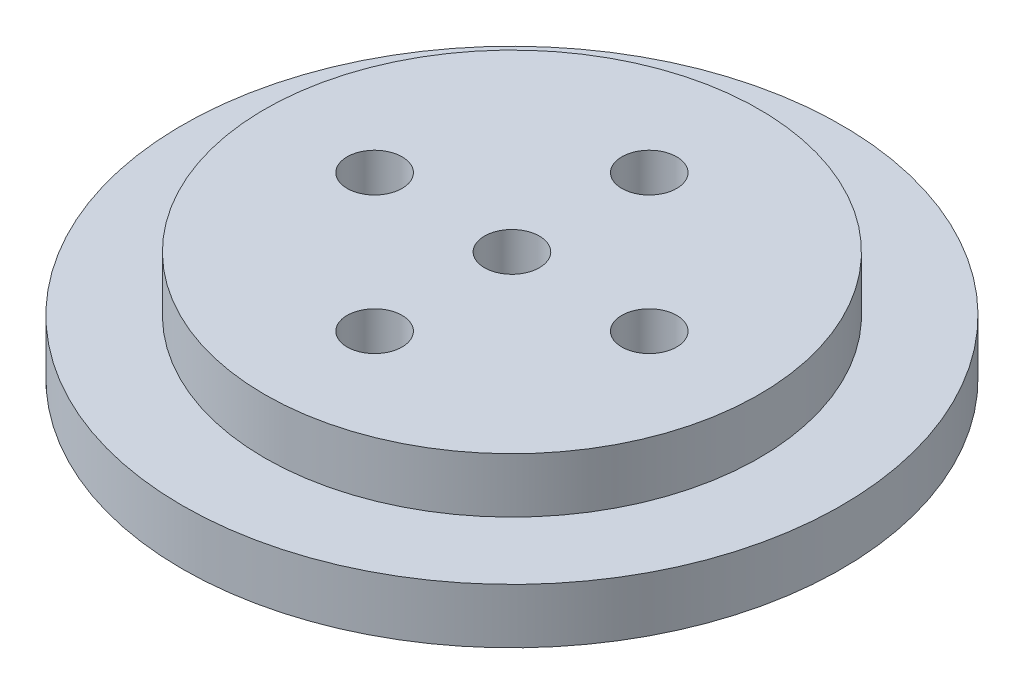
ISO-10303-21;
HEADER;
FILE_DESCRIPTION(('STEP AP214'),'2;1');
FILE_NAME('part.step','',(''),(''),'','','');
FILE_SCHEMA(('AUTOMOTIVE_DESIGN { 1 0 10303 214 1 1 1 1 }'));
ENDSEC;
DATA;
#1=APPLICATION_CONTEXT('core data for automotive mechanical design processes');
#2=APPLICATION_PROTOCOL_DEFINITION('international standard','automotive_design',2000,#1);
#3=PRODUCT_CONTEXT('',#1,'mechanical');
#4=PRODUCT('Part','Part','',(#3));
#5=PRODUCT_RELATED_PRODUCT_CATEGORY('part','',(#4));
#6=PRODUCT_DEFINITION_FORMATION('','',#4);
#7=PRODUCT_DEFINITION_CONTEXT('part definition',#1,'design');
#8=PRODUCT_DEFINITION('design','',#6,#7);
#9=PRODUCT_DEFINITION_SHAPE('','',#8);
#10=(LENGTH_UNIT() NAMED_UNIT(*) SI_UNIT(.MILLI.,.METRE.));
#11=(NAMED_UNIT(*) PLANE_ANGLE_UNIT() SI_UNIT($,.RADIAN.));
#12=(NAMED_UNIT(*) SI_UNIT($,.STERADIAN.) SOLID_ANGLE_UNIT());
#13=UNCERTAINTY_MEASURE_WITH_UNIT(LENGTH_MEASURE(1.E-05),#10,'distance_accuracy_value','');
#14=(GEOMETRIC_REPRESENTATION_CONTEXT(3) GLOBAL_UNCERTAINTY_ASSIGNED_CONTEXT((#13)) GLOBAL_UNIT_ASSIGNED_CONTEXT((#10,
#11,#12)) REPRESENTATION_CONTEXT('',''));
#15=CARTESIAN_POINT('',(0.,0.,0.));
#16=DIRECTION('',(0.,0.,1.));
#17=DIRECTION('',(1.,0.,0.));
#18=AXIS2_PLACEMENT_3D('',#15,#16,#17);
#19=CARTESIAN_POINT('',(0.,30.,0.));
#20=DIRECTION('',(0.,-1.,0.));
#21=DIRECTION('',(0.,0.,-1.));
#22=AXIS2_PLACEMENT_3D('',#19,#20,#21);
#23=CYLINDRICAL_SURFACE('',#22,45.);
#24=CARTESIAN_POINT('',(0.,0.,0.));
#25=DIRECTION('',(0.,1.,0.));
#26=DIRECTION('',(0.,0.,1.));
#27=AXIS2_PLACEMENT_3D('',#24,#25,#26);
#28=CIRCLE('',#27,45.);
#29=CARTESIAN_POINT('',(0.,0.,45.));
#30=VERTEX_POINT('',#29);
#31=EDGE_CURVE('E70',#30,#30,#28,.T.);
#32=ORIENTED_EDGE('',*,*,#31,.T.);
#33=EDGE_LOOP('',(#32));
#34=FACE_BOUND('',#33,.T.);
#35=CARTESIAN_POINT('',(0.,9.99999999999999,0.));
#36=DIRECTION('',(0.,1.,0.));
#37=DIRECTION('',(0.,0.,1.));
#38=AXIS2_PLACEMENT_3D('',#35,#36,#37);
#39=CIRCLE('',#38,45.);
#40=CARTESIAN_POINT('',(0.,9.99999999999999,45.));
#41=VERTEX_POINT('',#40);
#42=EDGE_CURVE('E12',#41,#41,#39,.T.);
#43=ORIENTED_EDGE('',*,*,#42,.F.);
#44=EDGE_LOOP('',(#43));
#45=FACE_BOUND('',#44,.T.);
#46=ADVANCED_FACE('F56',(#34,#45),#23,.T.);
#47=CARTESIAN_POINT('',(0.,30.,0.));
#48=DIRECTION('',(0.,1.,0.));
#49=DIRECTION('',(0.,0.,1.));
#50=AXIS2_PLACEMENT_3D('',#47,#48,#49);
#51=PLANE('',#50);
#52=CARTESIAN_POINT('',(0.,30.,25.));
#53=DIRECTION('',(0.,1.,0.));
#54=DIRECTION('',(0.,0.,1.));
#55=AXIS2_PLACEMENT_3D('',#52,#53,#54);
#56=CIRCLE('',#55,5.);
#57=CARTESIAN_POINT('',(0.,30.,30.));
#58=VERTEX_POINT('',#57);
#59=EDGE_CURVE('E99',#58,#58,#56,.T.);
#60=ORIENTED_EDGE('',*,*,#59,.F.);
#61=EDGE_LOOP('',(#60));
#62=FACE_BOUND('',#61,.T.);
#63=CARTESIAN_POINT('',(0.,30.,-25.));
#64=DIRECTION('',(0.,1.,0.));
#65=DIRECTION('',(0.,0.,1.));
#66=AXIS2_PLACEMENT_3D('',#63,#64,#65);
#67=CIRCLE('',#66,5.);
#68=CARTESIAN_POINT('',(0.,30.,-20.));
#69=VERTEX_POINT('',#68);
#70=EDGE_CURVE('E83',#69,#69,#67,.T.);
#71=ORIENTED_EDGE('',*,*,#70,.F.);
#72=EDGE_LOOP('',(#71));
#73=FACE_BOUND('',#72,.T.);
#74=CARTESIAN_POINT('',(0.,30.,0.));
#75=DIRECTION('',(0.,1.,0.));
#76=DIRECTION('',(0.,0.,1.));
#77=AXIS2_PLACEMENT_3D('',#74,#75,#76);
#78=CIRCLE('',#77,45.);
#79=CARTESIAN_POINT('',(0.,30.,45.));
#80=VERTEX_POINT('',#79);
#81=EDGE_CURVE('E64',#80,#80,#78,.T.);
#82=ORIENTED_EDGE('',*,*,#81,.T.);
#83=EDGE_LOOP('',(#82));
#84=FACE_BOUND('',#83,.T.);
#85=CARTESIAN_POINT('',(0.,30.,0.));
#86=DIRECTION('',(0.,1.,0.));
#87=DIRECTION('',(0.,0.,1.));
#88=AXIS2_PLACEMENT_3D('',#85,#86,#87);
#89=CIRCLE('',#88,5.);
#90=CARTESIAN_POINT('',(0.,30.,5.));
#91=VERTEX_POINT('',#90);
#92=EDGE_CURVE('E77',#91,#91,#89,.T.);
#93=ORIENTED_EDGE('',*,*,#92,.F.);
#94=EDGE_LOOP('',(#93));
#95=FACE_BOUND('',#94,.T.);
#96=CARTESIAN_POINT('',(25.,30.,0.));
#97=DIRECTION('',(0.,1.,0.));
#98=DIRECTION('',(0.,0.,1.));
#99=AXIS2_PLACEMENT_3D('',#96,#97,#98);
#100=CIRCLE('',#99,5.);
#101=CARTESIAN_POINT('',(25.,30.,5.));
#102=VERTEX_POINT('',#101);
#103=EDGE_CURVE('E91',#102,#102,#100,.T.);
#104=ORIENTED_EDGE('',*,*,#103,.F.);
#105=EDGE_LOOP('',(#104));
#106=FACE_BOUND('',#105,.T.);
#107=CARTESIAN_POINT('',(-25.,30.,0.));
#108=DIRECTION('',(0.,1.,0.));
#109=DIRECTION('',(0.,0.,1.));
#110=AXIS2_PLACEMENT_3D('',#107,#108,#109);
#111=CIRCLE('',#110,5.);
#112=CARTESIAN_POINT('',(-25.,30.,5.));
#113=VERTEX_POINT('',#112);
#114=EDGE_CURVE('E107',#113,#113,#111,.T.);
#115=ORIENTED_EDGE('',*,*,#114,.F.);
#116=EDGE_LOOP('',(#115));
#117=FACE_BOUND('',#116,.T.);
#118=ADVANCED_FACE('F156',(#62,#73,#84,#95,#106,#117),#51,.T.);
#119=CARTESIAN_POINT('',(0.,0.,0.));
#120=DIRECTION('',(0.,1.,0.));
#121=DIRECTION('',(0.,0.,1.));
#122=AXIS2_PLACEMENT_3D('',#119,#120,#121);
#123=PLANE('',#122);
#124=ORIENTED_EDGE('',*,*,#31,.F.);
#125=EDGE_LOOP('',(#124));
#126=FACE_BOUND('',#125,.T.);
#127=CARTESIAN_POINT('',(0.,0.,0.));
#128=DIRECTION('',(0.,1.,0.));
#129=DIRECTION('',(0.,0.,1.));
#130=AXIS2_PLACEMENT_3D('',#127,#128,#129);
#131=CIRCLE('',#130,5.);
#132=CARTESIAN_POINT('',(0.,0.,5.));
#133=VERTEX_POINT('',#132);
#134=EDGE_CURVE('E79',#133,#133,#131,.T.);
#135=ORIENTED_EDGE('',*,*,#134,.T.);
#136=EDGE_LOOP('',(#135));
#137=FACE_BOUND('',#136,.T.);
#138=CARTESIAN_POINT('',(0.,0.,-25.));
#139=DIRECTION('',(0.,1.,0.));
#140=DIRECTION('',(0.,0.,1.));
#141=AXIS2_PLACEMENT_3D('',#138,#139,#140);
#142=CIRCLE('',#141,5.);
#143=CARTESIAN_POINT('',(0.,0.,-20.));
#144=VERTEX_POINT('',#143);
#145=EDGE_CURVE('E87',#144,#144,#142,.T.);
#146=ORIENTED_EDGE('',*,*,#145,.T.);
#147=EDGE_LOOP('',(#146));
#148=FACE_BOUND('',#147,.T.);
#149=CARTESIAN_POINT('',(25.,0.,0.));
#150=DIRECTION('',(0.,1.,0.));
#151=DIRECTION('',(0.,0.,1.));
#152=AXIS2_PLACEMENT_3D('',#149,#150,#151);
#153=CIRCLE('',#152,5.);
#154=CARTESIAN_POINT('',(25.,0.,5.));
#155=VERTEX_POINT('',#154);
#156=EDGE_CURVE('E95',#155,#155,#153,.T.);
#157=ORIENTED_EDGE('',*,*,#156,.T.);
#158=EDGE_LOOP('',(#157));
#159=FACE_BOUND('',#158,.T.);
#160=CARTESIAN_POINT('',(0.,0.,25.));
#161=DIRECTION('',(0.,1.,0.));
#162=DIRECTION('',(0.,0.,1.));
#163=AXIS2_PLACEMENT_3D('',#160,#161,#162);
#164=CIRCLE('',#163,5.);
#165=CARTESIAN_POINT('',(0.,0.,30.));
#166=VERTEX_POINT('',#165);
#167=EDGE_CURVE('E103',#166,#166,#164,.T.);
#168=ORIENTED_EDGE('',*,*,#167,.T.);
#169=EDGE_LOOP('',(#168));
#170=FACE_BOUND('',#169,.T.);
#171=CARTESIAN_POINT('',(-25.,0.,0.));
#172=DIRECTION('',(0.,1.,0.));
#173=DIRECTION('',(0.,0.,1.));
#174=AXIS2_PLACEMENT_3D('',#171,#172,#173);
#175=CIRCLE('',#174,5.);
#176=CARTESIAN_POINT('',(-25.,0.,5.));
#177=VERTEX_POINT('',#176);
#178=EDGE_CURVE('E111',#177,#177,#175,.T.);
#179=ORIENTED_EDGE('',*,*,#178,.T.);
#180=EDGE_LOOP('',(#179));
#181=FACE_BOUND('',#180,.T.);
#182=ADVANCED_FACE('F161',(#126,#137,#148,#159,#170,#181),#123,.F.);
#183=CARTESIAN_POINT('',(0.,20.,0.));
#184=DIRECTION('',(0.,1.,0.));
#185=DIRECTION('',(0.,0.,1.));
#186=AXIS2_PLACEMENT_3D('',#183,#184,#185);
#187=CIRCLE('',#186,45.);
#188=CARTESIAN_POINT('',(0.,20.,45.));
#189=VERTEX_POINT('',#188);
#190=EDGE_CURVE('E123',#189,#189,#187,.T.);
#191=ORIENTED_EDGE('',*,*,#190,.T.);
#192=EDGE_LOOP('',(#191));
#193=FACE_BOUND('',#192,.T.);
#194=ORIENTED_EDGE('',*,*,#81,.F.);
#195=EDGE_LOOP('',(#194));
#196=FACE_BOUND('',#195,.T.);
#197=ADVANCED_FACE('F58',(#193,#196),#23,.T.);
#198=CARTESIAN_POINT('',(0.,30.,0.));
#199=DIRECTION('',(0.,-1.,0.));
#200=DIRECTION('',(0.,0.,-1.));
#201=AXIS2_PLACEMENT_3D('',#198,#199,#200);
#202=CYLINDRICAL_SURFACE('',#201,5.);
#203=ORIENTED_EDGE('',*,*,#92,.T.);
#204=EDGE_LOOP('',(#203));
#205=FACE_BOUND('',#204,.T.);
#206=ORIENTED_EDGE('',*,*,#134,.F.);
#207=EDGE_LOOP('',(#206));
#208=FACE_BOUND('',#207,.T.);
#209=ADVANCED_FACE('F165',(#205,#208),#202,.F.);
#210=CARTESIAN_POINT('',(0.,30.,-25.));
#211=DIRECTION('',(0.,-1.,0.));
#212=DIRECTION('',(0.,0.,-1.));
#213=AXIS2_PLACEMENT_3D('',#210,#211,#212);
#214=CYLINDRICAL_SURFACE('',#213,5.);
#215=ORIENTED_EDGE('',*,*,#70,.T.);
#216=EDGE_LOOP('',(#215));
#217=FACE_BOUND('',#216,.T.);
#218=ORIENTED_EDGE('',*,*,#145,.F.);
#219=EDGE_LOOP('',(#218));
#220=FACE_BOUND('',#219,.T.);
#221=ADVANCED_FACE('F169',(#217,#220),#214,.F.);
#222=CARTESIAN_POINT('',(25.,30.,0.));
#223=DIRECTION('',(0.,-1.,0.));
#224=DIRECTION('',(0.,0.,-1.));
#225=AXIS2_PLACEMENT_3D('',#222,#223,#224);
#226=CYLINDRICAL_SURFACE('',#225,5.);
#227=ORIENTED_EDGE('',*,*,#103,.T.);
#228=EDGE_LOOP('',(#227));
#229=FACE_BOUND('',#228,.T.);
#230=ORIENTED_EDGE('',*,*,#156,.F.);
#231=EDGE_LOOP('',(#230));
#232=FACE_BOUND('',#231,.T.);
#233=ADVANCED_FACE('F181',(#229,#232),#226,.F.);
#234=CARTESIAN_POINT('',(0.,30.,25.));
#235=DIRECTION('',(0.,-1.,0.));
#236=DIRECTION('',(0.,0.,-1.));
#237=AXIS2_PLACEMENT_3D('',#234,#235,#236);
#238=CYLINDRICAL_SURFACE('',#237,5.);
#239=ORIENTED_EDGE('',*,*,#59,.T.);
#240=EDGE_LOOP('',(#239));
#241=FACE_BOUND('',#240,.T.);
#242=ORIENTED_EDGE('',*,*,#167,.F.);
#243=EDGE_LOOP('',(#242));
#244=FACE_BOUND('',#243,.T.);
#245=ADVANCED_FACE('F152',(#241,#244),#238,.F.);
#246=CARTESIAN_POINT('',(-25.,30.,0.));
#247=DIRECTION('',(0.,-1.,0.));
#248=DIRECTION('',(0.,0.,-1.));
#249=AXIS2_PLACEMENT_3D('',#246,#247,#248);
#250=CYLINDRICAL_SURFACE('',#249,5.);
#251=ORIENTED_EDGE('',*,*,#114,.T.);
#252=EDGE_LOOP('',(#251));
#253=FACE_BOUND('',#252,.T.);
#254=ORIENTED_EDGE('',*,*,#178,.F.);
#255=EDGE_LOOP('',(#254));
#256=FACE_BOUND('',#255,.T.);
#257=ADVANCED_FACE('F143',(#253,#256),#250,.F.);
#258=CARTESIAN_POINT('',(0.,10.,0.));
#259=DIRECTION('',(0.,1.,0.));
#260=DIRECTION('',(0.,0.,1.));
#261=AXIS2_PLACEMENT_3D('',#258,#259,#260);
#262=CYLINDRICAL_SURFACE('',#261,60.);
#263=CARTESIAN_POINT('',(0.,10.,0.));
#264=DIRECTION('',(0.,1.,0.));
#265=DIRECTION('',(0.,0.,1.));
#266=AXIS2_PLACEMENT_3D('',#263,#264,#265);
#267=CIRCLE('',#266,60.);
#268=CARTESIAN_POINT('',(0.,10.,60.));
#269=VERTEX_POINT('',#268);
#270=EDGE_CURVE('E115',#269,#269,#267,.T.);
#271=ORIENTED_EDGE('',*,*,#270,.T.);
#272=EDGE_LOOP('',(#271));
#273=FACE_BOUND('',#272,.T.);
#274=CARTESIAN_POINT('',(0.,20.,0.));
#275=DIRECTION('',(0.,1.,0.));
#276=DIRECTION('',(0.,0.,1.));
#277=AXIS2_PLACEMENT_3D('',#274,#275,#276);
#278=CIRCLE('',#277,60.);
#279=CARTESIAN_POINT('',(0.,20.,60.));
#280=VERTEX_POINT('',#279);
#281=EDGE_CURVE('E119',#280,#280,#278,.T.);
#282=ORIENTED_EDGE('',*,*,#281,.F.);
#283=EDGE_LOOP('',(#282));
#284=FACE_BOUND('',#283,.T.);
#285=ADVANCED_FACE('F141',(#273,#284),#262,.T.);
#286=CARTESIAN_POINT('',(0.,10.,0.));
#287=DIRECTION('',(0.,1.,0.));
#288=DIRECTION('',(0.,0.,1.));
#289=AXIS2_PLACEMENT_3D('',#286,#287,#288);
#290=PLANE('',#289);
#291=ORIENTED_EDGE('',*,*,#42,.T.);
#292=EDGE_LOOP('',(#291));
#293=FACE_BOUND('',#292,.T.);
#294=ORIENTED_EDGE('',*,*,#270,.F.);
#295=EDGE_LOOP('',(#294));
#296=FACE_BOUND('',#295,.T.);
#297=ADVANCED_FACE('F137',(#293,#296),#290,.F.);
#298=CARTESIAN_POINT('',(0.,20.,0.));
#299=DIRECTION('',(0.,1.,0.));
#300=DIRECTION('',(0.,0.,1.));
#301=AXIS2_PLACEMENT_3D('',#298,#299,#300);
#302=PLANE('',#301);
#303=ORIENTED_EDGE('',*,*,#190,.F.);
#304=EDGE_LOOP('',(#303));
#305=FACE_BOUND('',#304,.T.);
#306=ORIENTED_EDGE('',*,*,#281,.T.);
#307=EDGE_LOOP('',(#306));
#308=FACE_BOUND('',#307,.T.);
#309=ADVANCED_FACE('F134',(#305,#308),#302,.T.);
#310=CLOSED_SHELL('',(#46,#118,#182,#197,#209,#221,#233,#245,#257,#285,#297,#309));
#311=MANIFOLD_SOLID_BREP('B2',#310);
#312=ADVANCED_BREP_SHAPE_REPRESENTATION('',(#18,#311),#14);
#313=SHAPE_DEFINITION_REPRESENTATION(#9,#312);
ENDSEC;
END-ISO-10303-21;
